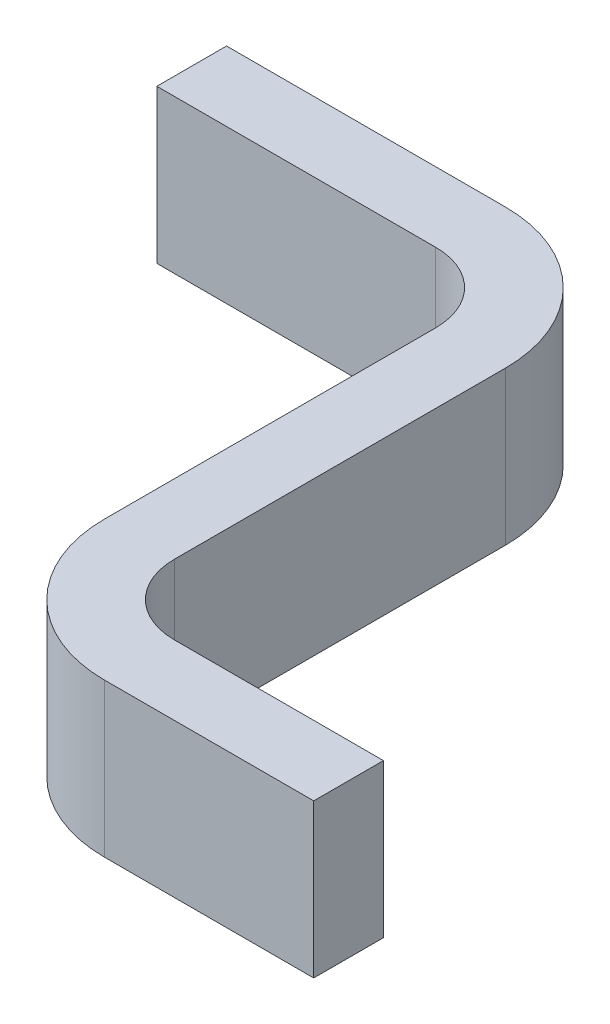
ISO-10303-21;
HEADER;
FILE_DESCRIPTION(('STEP AP214'),'2;1');
FILE_NAME('part.step','',(''),(''),'','','');
FILE_SCHEMA(('AUTOMOTIVE_DESIGN { 1 0 10303 214 1 1 1 1 }'));
ENDSEC;
DATA;
#1=APPLICATION_CONTEXT('core data for automotive mechanical design processes');
#2=APPLICATION_PROTOCOL_DEFINITION('international standard','automotive_design',2000,#1);
#3=PRODUCT_CONTEXT('',#1,'mechanical');
#4=PRODUCT('Part','Part','',(#3));
#5=PRODUCT_RELATED_PRODUCT_CATEGORY('part','',(#4));
#6=PRODUCT_DEFINITION_FORMATION('','',#4);
#7=PRODUCT_DEFINITION_CONTEXT('part definition',#1,'design');
#8=PRODUCT_DEFINITION('design','',#6,#7);
#9=PRODUCT_DEFINITION_SHAPE('','',#8);
#10=(LENGTH_UNIT() NAMED_UNIT(*) SI_UNIT(.MILLI.,.METRE.));
#11=(NAMED_UNIT(*) PLANE_ANGLE_UNIT() SI_UNIT($,.RADIAN.));
#12=(NAMED_UNIT(*) SI_UNIT($,.STERADIAN.) SOLID_ANGLE_UNIT());
#13=UNCERTAINTY_MEASURE_WITH_UNIT(LENGTH_MEASURE(1.E-05),#10,'distance_accuracy_value','');
#14=(GEOMETRIC_REPRESENTATION_CONTEXT(3) GLOBAL_UNCERTAINTY_ASSIGNED_CONTEXT((#13)) GLOBAL_UNIT_ASSIGNED_CONTEXT((#10,
#11,#12)) REPRESENTATION_CONTEXT('',''));
#15=CARTESIAN_POINT('',(0.,0.,0.));
#16=DIRECTION('',(0.,0.,1.));
#17=DIRECTION('',(1.,0.,0.));
#18=AXIS2_PLACEMENT_3D('',#15,#16,#17);
#19=CARTESIAN_POINT('',(-4.,-1.14,0.675));
#20=DIRECTION('',(0.,-1.,0.));
#21=DIRECTION('',(1.,0.,0.));
#22=AXIS2_PLACEMENT_3D('',#19,#20,#21);
#23=PLANE('',#22);
#24=CARTESIAN_POINT('',(-3.80000000000001,-1.14,0.675));
#25=DIRECTION('',(0.,1.,0.));
#26=DIRECTION('',(-1.,0.,0.));
#27=AXIS2_PLACEMENT_3D('',#24,#25,#26);
#28=CIRCLE('',#27,0.2);
#29=CARTESIAN_POINT('',(-3.80000000000001,-1.14,0.875));
#30=VERTEX_POINT('',#29);
#31=CARTESIAN_POINT('',(-4.,-1.14,0.675));
#32=VERTEX_POINT('',#31);
#33=EDGE_CURVE('E150',#30,#32,#28,.F.);
#34=ORIENTED_EDGE('',*,*,#33,.F.);
#35=DIRECTION('',(-1.,0.,0.));
#36=VECTOR('',#35,1.);
#37=CARTESIAN_POINT('',(-3.5,-1.14,0.875));
#38=LINE('',#37,#36);
#39=CARTESIAN_POINT('',(-3.5,-1.14,0.875));
#40=VERTEX_POINT('',#39);
#41=EDGE_CURVE('E147',#30,#40,#38,.F.);
#42=ORIENTED_EDGE('',*,*,#41,.T.);
#43=DIRECTION('',(0.,0.,1.));
#44=VECTOR('',#43,1.);
#45=CARTESIAN_POINT('',(-3.5,-1.14,0.775));
#46=LINE('',#45,#44);
#47=CARTESIAN_POINT('',(-3.5,-1.14,0.775));
#48=VERTEX_POINT('',#47);
#49=EDGE_CURVE('E141',#48,#40,#46,.T.);
#50=ORIENTED_EDGE('',*,*,#49,.F.);
#51=DIRECTION('',(1.,0.,0.));
#52=VECTOR('',#51,1.);
#53=CARTESIAN_POINT('',(-3.5,-1.14,0.775));
#54=LINE('',#53,#52);
#55=CARTESIAN_POINT('',(-3.80000000000001,-1.14,0.775));
#56=VERTEX_POINT('',#55);
#57=EDGE_CURVE('E115',#48,#56,#54,.F.);
#58=ORIENTED_EDGE('',*,*,#57,.T.);
#59=CARTESIAN_POINT('',(-3.80000000000001,-1.14,0.675));
#60=DIRECTION('',(0.,1.,0.));
#61=DIRECTION('',(-1.,0.,0.));
#62=AXIS2_PLACEMENT_3D('',#59,#60,#61);
#63=CIRCLE('',#62,0.1);
#64=CARTESIAN_POINT('',(-3.9,-1.14,0.675));
#65=VERTEX_POINT('',#64);
#66=EDGE_CURVE('E215',#56,#65,#63,.F.);
#67=ORIENTED_EDGE('',*,*,#66,.T.);
#68=DIRECTION('',(0.,0.,1.));
#69=VECTOR('',#68,1.);
#70=CARTESIAN_POINT('',(-3.9,-1.14,0.675));
#71=LINE('',#70,#69);
#72=CARTESIAN_POINT('',(-3.9,-1.14,0.2));
#73=VERTEX_POINT('',#72);
#74=EDGE_CURVE('E181',#65,#73,#71,.F.);
#75=ORIENTED_EDGE('',*,*,#74,.T.);
#76=CARTESIAN_POINT('',(-4.1,-1.14,0.2));
#77=DIRECTION('',(0.,-1.,0.));
#78=DIRECTION('',(1.,0.,0.));
#79=AXIS2_PLACEMENT_3D('',#76,#77,#78);
#80=CIRCLE('',#79,0.2);
#81=CARTESIAN_POINT('',(-4.1,-1.14,0.));
#82=VERTEX_POINT('',#81);
#83=EDGE_CURVE('E20',#82,#73,#80,.T.);
#84=ORIENTED_EDGE('',*,*,#83,.F.);
#85=DIRECTION('',(1.,0.,0.));
#86=VECTOR('',#85,1.);
#87=CARTESIAN_POINT('',(-4.1,-1.14,0.));
#88=LINE('',#87,#86);
#89=CARTESIAN_POINT('',(-4.5,-1.14,0.));
#90=VERTEX_POINT('',#89);
#91=EDGE_CURVE('E91',#82,#90,#88,.F.);
#92=ORIENTED_EDGE('',*,*,#91,.T.);
#93=DIRECTION('',(0.,0.,1.));
#94=VECTOR('',#93,1.);
#95=CARTESIAN_POINT('',(-4.5,-1.14,0.));
#96=LINE('',#95,#94);
#97=CARTESIAN_POINT('',(-4.5,-1.14,0.1));
#98=VERTEX_POINT('',#97);
#99=EDGE_CURVE('E163',#90,#98,#96,.T.);
#100=ORIENTED_EDGE('',*,*,#99,.T.);
#101=DIRECTION('',(-1.,0.,0.));
#102=VECTOR('',#101,1.);
#103=CARTESIAN_POINT('',(-4.1,-1.14,0.1));
#104=LINE('',#103,#102);
#105=CARTESIAN_POINT('',(-4.1,-1.14,0.1));
#106=VERTEX_POINT('',#105);
#107=EDGE_CURVE('E159',#98,#106,#104,.F.);
#108=ORIENTED_EDGE('',*,*,#107,.T.);
#109=CARTESIAN_POINT('',(-4.1,-1.14,0.2));
#110=DIRECTION('',(0.,-1.,0.));
#111=DIRECTION('',(1.,0.,0.));
#112=AXIS2_PLACEMENT_3D('',#109,#110,#111);
#113=CIRCLE('',#112,0.1);
#114=CARTESIAN_POINT('',(-4.,-1.14,0.2));
#115=VERTEX_POINT('',#114);
#116=EDGE_CURVE('E155',#106,#115,#113,.T.);
#117=ORIENTED_EDGE('',*,*,#116,.T.);
#118=DIRECTION('',(0.,0.,1.));
#119=VECTOR('',#118,1.);
#120=CARTESIAN_POINT('',(-4.,-1.14,0.675));
#121=LINE('',#120,#119);
#122=EDGE_CURVE('E154',#115,#32,#121,.T.);
#123=ORIENTED_EDGE('',*,*,#122,.T.);
#124=EDGE_LOOP('',(#34,#42,#50,#58,#67,#75,#84,#92,#100,#108,#117,#123));
#125=FACE_BOUND('',#124,.T.);
#126=ADVANCED_FACE('F17',(#125),#23,.F.);
#127=CARTESIAN_POINT('',(-4.1,-1.14,0.2));
#128=DIRECTION('',(0.,-1.,0.));
#129=DIRECTION('',(1.,0.,0.));
#130=AXIS2_PLACEMENT_3D('',#127,#128,#129);
#131=CYLINDRICAL_SURFACE('',#130,0.2);
#132=CARTESIAN_POINT('',(-4.1,-1.36,0.2));
#133=DIRECTION('',(0.,-1.,0.));
#134=DIRECTION('',(1.,0.,0.));
#135=AXIS2_PLACEMENT_3D('',#132,#133,#134);
#136=CIRCLE('',#135,0.2);
#137=CARTESIAN_POINT('',(-3.9,-1.36,0.2));
#138=VERTEX_POINT('',#137);
#139=CARTESIAN_POINT('',(-4.1,-1.36,0.));
#140=VERTEX_POINT('',#139);
#141=EDGE_CURVE('E183',#138,#140,#136,.F.);
#142=ORIENTED_EDGE('',*,*,#141,.T.);
#143=DIRECTION('',(0.,1.,0.));
#144=VECTOR('',#143,1.);
#145=CARTESIAN_POINT('',(-4.1,-1.14,0.));
#146=LINE('',#145,#144);
#147=EDGE_CURVE('E178',#140,#82,#146,.T.);
#148=ORIENTED_EDGE('',*,*,#147,.T.);
#149=ORIENTED_EDGE('',*,*,#83,.T.);
#150=DIRECTION('',(0.,-1.,0.));
#151=VECTOR('',#150,1.);
#152=CARTESIAN_POINT('',(-3.9,-1.14,0.2));
#153=LINE('',#152,#151);
#154=EDGE_CURVE('E217',#73,#138,#153,.T.);
#155=ORIENTED_EDGE('',*,*,#154,.T.);
#156=EDGE_LOOP('',(#142,#148,#149,#155));
#157=FACE_BOUND('',#156,.T.);
#158=ADVANCED_FACE('F254',(#157),#131,.T.);
#159=CARTESIAN_POINT('',(-4.1,-1.14,0.));
#160=DIRECTION('',(0.,0.,1.));
#161=DIRECTION('',(1.,0.,0.));
#162=AXIS2_PLACEMENT_3D('',#159,#160,#161);
#163=PLANE('',#162);
#164=ORIENTED_EDGE('',*,*,#147,.F.);
#165=DIRECTION('',(-1.,0.,0.));
#166=VECTOR('',#165,1.);
#167=CARTESIAN_POINT('',(-3.9,-1.36,0.));
#168=LINE('',#167,#166);
#169=CARTESIAN_POINT('',(-4.5,-1.36,0.));
#170=VERTEX_POINT('',#169);
#171=EDGE_CURVE('E170',#140,#170,#168,.T.);
#172=ORIENTED_EDGE('',*,*,#171,.T.);
#173=DIRECTION('',(0.,1.,0.));
#174=VECTOR('',#173,1.);
#175=CARTESIAN_POINT('',(-4.5,-1.14,0.));
#176=LINE('',#175,#174);
#177=EDGE_CURVE('E173',#170,#90,#176,.T.);
#178=ORIENTED_EDGE('',*,*,#177,.T.);
#179=ORIENTED_EDGE('',*,*,#91,.F.);
#180=EDGE_LOOP('',(#164,#172,#178,#179));
#181=FACE_BOUND('',#180,.T.);
#182=ADVANCED_FACE('F257',(#181),#163,.F.);
#183=CARTESIAN_POINT('',(-4.5,-1.14,0.));
#184=DIRECTION('',(1.,0.,0.));
#185=DIRECTION('',(0.,1.,0.));
#186=AXIS2_PLACEMENT_3D('',#183,#184,#185);
#187=PLANE('',#186);
#188=DIRECTION('',(0.,1.,0.));
#189=VECTOR('',#188,1.);
#190=CARTESIAN_POINT('',(-4.5,-1.36,0.1));
#191=LINE('',#190,#189);
#192=CARTESIAN_POINT('',(-4.5,-1.36,0.1));
#193=VERTEX_POINT('',#192);
#194=EDGE_CURVE('E160',#193,#98,#191,.T.);
#195=ORIENTED_EDGE('',*,*,#194,.T.);
#196=ORIENTED_EDGE('',*,*,#99,.F.);
#197=ORIENTED_EDGE('',*,*,#177,.F.);
#198=DIRECTION('',(0.,0.,1.));
#199=VECTOR('',#198,1.);
#200=CARTESIAN_POINT('',(-4.5,-1.36,0.675));
#201=LINE('',#200,#199);
#202=EDGE_CURVE('E166',#170,#193,#201,.T.);
#203=ORIENTED_EDGE('',*,*,#202,.T.);
#204=EDGE_LOOP('',(#195,#196,#197,#203));
#205=FACE_BOUND('',#204,.T.);
#206=ADVANCED_FACE('F259',(#205),#187,.F.);
#207=CARTESIAN_POINT('',(-4.1,-1.36,0.1));
#208=DIRECTION('',(0.,0.,-1.));
#209=DIRECTION('',(-1.,0.,0.));
#210=AXIS2_PLACEMENT_3D('',#207,#208,#209);
#211=PLANE('',#210);
#212=DIRECTION('',(0.,-1.,0.));
#213=VECTOR('',#212,1.);
#214=CARTESIAN_POINT('',(-4.1,-1.36,0.1));
#215=LINE('',#214,#213);
#216=CARTESIAN_POINT('',(-4.1,-1.36,0.1));
#217=VERTEX_POINT('',#216);
#218=EDGE_CURVE('E156',#217,#106,#215,.F.);
#219=ORIENTED_EDGE('',*,*,#218,.T.);
#220=ORIENTED_EDGE('',*,*,#107,.F.);
#221=ORIENTED_EDGE('',*,*,#194,.F.);
#222=DIRECTION('',(-1.,0.,0.));
#223=VECTOR('',#222,1.);
#224=CARTESIAN_POINT('',(-3.9,-1.36,0.1));
#225=LINE('',#224,#223);
#226=EDGE_CURVE('E169',#193,#217,#225,.F.);
#227=ORIENTED_EDGE('',*,*,#226,.T.);
#228=EDGE_LOOP('',(#219,#220,#221,#227));
#229=FACE_BOUND('',#228,.T.);
#230=ADVANCED_FACE('F234',(#229),#211,.F.);
#231=CARTESIAN_POINT('',(-4.1,-1.36,0.2));
#232=DIRECTION('',(0.,-1.,0.));
#233=DIRECTION('',(1.,0.,0.));
#234=AXIS2_PLACEMENT_3D('',#231,#232,#233);
#235=CYLINDRICAL_SURFACE('',#234,0.1);
#236=DIRECTION('',(0.,1.,0.));
#237=VECTOR('',#236,1.);
#238=CARTESIAN_POINT('',(-4.,-1.36,0.2));
#239=LINE('',#238,#237);
#240=CARTESIAN_POINT('',(-4.,-1.36,0.2));
#241=VERTEX_POINT('',#240);
#242=EDGE_CURVE('E151',#241,#115,#239,.T.);
#243=ORIENTED_EDGE('',*,*,#242,.T.);
#244=ORIENTED_EDGE('',*,*,#116,.F.);
#245=ORIENTED_EDGE('',*,*,#218,.F.);
#246=CARTESIAN_POINT('',(-4.1,-1.36,0.2));
#247=DIRECTION('',(0.,-1.,0.));
#248=DIRECTION('',(1.,0.,0.));
#249=AXIS2_PLACEMENT_3D('',#246,#247,#248);
#250=CIRCLE('',#249,0.1);
#251=EDGE_CURVE('E210',#217,#241,#250,.T.);
#252=ORIENTED_EDGE('',*,*,#251,.T.);
#253=EDGE_LOOP('',(#243,#244,#245,#252));
#254=FACE_BOUND('',#253,.T.);
#255=ADVANCED_FACE('F227',(#254),#235,.F.);
#256=CARTESIAN_POINT('',(-4.,-1.36,0.675));
#257=DIRECTION('',(1.,0.,0.));
#258=DIRECTION('',(0.,1.,0.));
#259=AXIS2_PLACEMENT_3D('',#256,#257,#258);
#260=PLANE('',#259);
#261=DIRECTION('',(0.,1.,0.));
#262=VECTOR('',#261,1.);
#263=CARTESIAN_POINT('',(-4.,-1.36,0.675));
#264=LINE('',#263,#262);
#265=CARTESIAN_POINT('',(-4.,-1.36,0.675));
#266=VERTEX_POINT('',#265);
#267=EDGE_CURVE('E148',#32,#266,#264,.F.);
#268=ORIENTED_EDGE('',*,*,#267,.F.);
#269=ORIENTED_EDGE('',*,*,#122,.F.);
#270=ORIENTED_EDGE('',*,*,#242,.F.);
#271=DIRECTION('',(0.,0.,1.));
#272=VECTOR('',#271,1.);
#273=CARTESIAN_POINT('',(-4.,-1.36,0.675));
#274=LINE('',#273,#272);
#275=EDGE_CURVE('E209',#241,#266,#274,.T.);
#276=ORIENTED_EDGE('',*,*,#275,.T.);
#277=EDGE_LOOP('',(#268,#269,#270,#276));
#278=FACE_BOUND('',#277,.T.);
#279=ADVANCED_FACE('F224',(#278),#260,.F.);
#280=CARTESIAN_POINT('',(-3.8,-1.36,0.675));
#281=DIRECTION('',(0.,1.,0.));
#282=DIRECTION('',(-1.,0.,0.));
#283=AXIS2_PLACEMENT_3D('',#280,#281,#282);
#284=CYLINDRICAL_SURFACE('',#283,0.2);
#285=ORIENTED_EDGE('',*,*,#33,.T.);
#286=ORIENTED_EDGE('',*,*,#267,.T.);
#287=CARTESIAN_POINT('',(-3.8,-1.36,0.675));
#288=DIRECTION('',(0.,1.,0.));
#289=DIRECTION('',(-1.,0.,0.));
#290=AXIS2_PLACEMENT_3D('',#287,#288,#289);
#291=CIRCLE('',#290,0.2);
#292=CARTESIAN_POINT('',(-3.8,-1.36,0.875));
#293=VERTEX_POINT('',#292);
#294=EDGE_CURVE('E133',#266,#293,#291,.T.);
#295=ORIENTED_EDGE('',*,*,#294,.T.);
#296=DIRECTION('',(0.,1.,0.));
#297=VECTOR('',#296,1.);
#298=CARTESIAN_POINT('',(-3.8,-1.36,0.875));
#299=LINE('',#298,#297);
#300=EDGE_CURVE('E144',#293,#30,#299,.T.);
#301=ORIENTED_EDGE('',*,*,#300,.T.);
#302=EDGE_LOOP('',(#285,#286,#295,#301));
#303=FACE_BOUND('',#302,.T.);
#304=ADVANCED_FACE('F285',(#303),#284,.T.);
#305=CARTESIAN_POINT('',(-3.5,-1.36,0.875));
#306=DIRECTION('',(0.,0.,-1.));
#307=DIRECTION('',(-1.,0.,0.));
#308=AXIS2_PLACEMENT_3D('',#305,#306,#307);
#309=PLANE('',#308);
#310=DIRECTION('',(0.,1.,0.));
#311=VECTOR('',#310,1.);
#312=CARTESIAN_POINT('',(-3.5,-1.14,0.875));
#313=LINE('',#312,#311);
#314=CARTESIAN_POINT('',(-3.5,-1.36,0.875));
#315=VERTEX_POINT('',#314);
#316=EDGE_CURVE('E118',#40,#315,#313,.F.);
#317=ORIENTED_EDGE('',*,*,#316,.F.);
#318=ORIENTED_EDGE('',*,*,#41,.F.);
#319=ORIENTED_EDGE('',*,*,#300,.F.);
#320=DIRECTION('',(-1.,0.,0.));
#321=VECTOR('',#320,1.);
#322=CARTESIAN_POINT('',(-3.9,-1.36,0.875));
#323=LINE('',#322,#321);
#324=EDGE_CURVE('E131',#293,#315,#323,.F.);
#325=ORIENTED_EDGE('',*,*,#324,.T.);
#326=EDGE_LOOP('',(#317,#318,#319,#325));
#327=FACE_BOUND('',#326,.T.);
#328=ADVANCED_FACE('F282',(#327),#309,.F.);
#329=CARTESIAN_POINT('',(-3.5,-1.14,0.775));
#330=DIRECTION('',(1.,0.,0.));
#331=DIRECTION('',(0.,1.,0.));
#332=AXIS2_PLACEMENT_3D('',#329,#330,#331);
#333=PLANE('',#332);
#334=ORIENTED_EDGE('',*,*,#49,.T.);
#335=ORIENTED_EDGE('',*,*,#316,.T.);
#336=DIRECTION('',(0.,0.,1.));
#337=VECTOR('',#336,1.);
#338=CARTESIAN_POINT('',(-3.5,-1.36,0.675));
#339=LINE('',#338,#337);
#340=CARTESIAN_POINT('',(-3.5,-1.36,0.775));
#341=VERTEX_POINT('',#340);
#342=EDGE_CURVE('E125',#315,#341,#339,.F.);
#343=ORIENTED_EDGE('',*,*,#342,.T.);
#344=DIRECTION('',(0.,1.,0.));
#345=VECTOR('',#344,1.);
#346=CARTESIAN_POINT('',(-3.5,-1.14,0.775));
#347=LINE('',#346,#345);
#348=EDGE_CURVE('E110',#341,#48,#347,.T.);
#349=ORIENTED_EDGE('',*,*,#348,.T.);
#350=EDGE_LOOP('',(#334,#335,#343,#349));
#351=FACE_BOUND('',#350,.T.);
#352=ADVANCED_FACE('F129',(#351),#333,.T.);
#353=CARTESIAN_POINT('',(-3.5,-1.14,0.775));
#354=DIRECTION('',(0.,0.,1.));
#355=DIRECTION('',(1.,0.,0.));
#356=AXIS2_PLACEMENT_3D('',#353,#354,#355);
#357=PLANE('',#356);
#358=ORIENTED_EDGE('',*,*,#348,.F.);
#359=DIRECTION('',(-1.,0.,0.));
#360=VECTOR('',#359,1.);
#361=CARTESIAN_POINT('',(-3.9,-1.36,0.775));
#362=LINE('',#361,#360);
#363=CARTESIAN_POINT('',(-3.8,-1.36,0.775));
#364=VERTEX_POINT('',#363);
#365=EDGE_CURVE('E114',#341,#364,#362,.T.);
#366=ORIENTED_EDGE('',*,*,#365,.T.);
#367=DIRECTION('',(0.,1.,0.));
#368=VECTOR('',#367,1.);
#369=CARTESIAN_POINT('',(-3.80000000000001,-1.14,0.775));
#370=LINE('',#369,#368);
#371=EDGE_CURVE('E185',#364,#56,#370,.T.);
#372=ORIENTED_EDGE('',*,*,#371,.T.);
#373=ORIENTED_EDGE('',*,*,#57,.F.);
#374=EDGE_LOOP('',(#358,#366,#372,#373));
#375=FACE_BOUND('',#374,.T.);
#376=ADVANCED_FACE('F112',(#375),#357,.F.);
#377=CARTESIAN_POINT('',(-3.80000000000001,-1.14,0.675));
#378=DIRECTION('',(0.,1.,0.));
#379=DIRECTION('',(-1.,0.,0.));
#380=AXIS2_PLACEMENT_3D('',#377,#378,#379);
#381=CYLINDRICAL_SURFACE('',#380,0.1);
#382=ORIENTED_EDGE('',*,*,#371,.F.);
#383=CARTESIAN_POINT('',(-3.8,-1.36,0.675));
#384=DIRECTION('',(0.,1.,0.));
#385=DIRECTION('',(-1.,0.,0.));
#386=AXIS2_PLACEMENT_3D('',#383,#384,#385);
#387=CIRCLE('',#386,0.1);
#388=CARTESIAN_POINT('',(-3.9,-1.36,0.675));
#389=VERTEX_POINT('',#388);
#390=EDGE_CURVE('E26',#364,#389,#387,.F.);
#391=ORIENTED_EDGE('',*,*,#390,.T.);
#392=DIRECTION('',(0.,-1.,0.));
#393=VECTOR('',#392,1.);
#394=CARTESIAN_POINT('',(-3.9,-1.14,0.675));
#395=LINE('',#394,#393);
#396=EDGE_CURVE('E34',#389,#65,#395,.F.);
#397=ORIENTED_EDGE('',*,*,#396,.T.);
#398=ORIENTED_EDGE('',*,*,#66,.F.);
#399=EDGE_LOOP('',(#382,#391,#397,#398));
#400=FACE_BOUND('',#399,.T.);
#401=ADVANCED_FACE('F250',(#400),#381,.F.);
#402=CARTESIAN_POINT('',(-3.9,-1.14,0.675));
#403=DIRECTION('',(-1.,0.,0.));
#404=DIRECTION('',(0.,-1.,0.));
#405=AXIS2_PLACEMENT_3D('',#402,#403,#404);
#406=PLANE('',#405);
#407=ORIENTED_EDGE('',*,*,#396,.F.);
#408=DIRECTION('',(0.,0.,1.));
#409=VECTOR('',#408,1.);
#410=CARTESIAN_POINT('',(-3.9,-1.36,0.675));
#411=LINE('',#410,#409);
#412=EDGE_CURVE('E11',#389,#138,#411,.F.);
#413=ORIENTED_EDGE('',*,*,#412,.T.);
#414=ORIENTED_EDGE('',*,*,#154,.F.);
#415=ORIENTED_EDGE('',*,*,#74,.F.);
#416=EDGE_LOOP('',(#407,#413,#414,#415));
#417=FACE_BOUND('',#416,.T.);
#418=ADVANCED_FACE('F252',(#417),#406,.F.);
#419=CARTESIAN_POINT('',(-3.9,-1.36,0.675));
#420=DIRECTION('',(0.,1.,0.));
#421=DIRECTION('',(-1.,0.,0.));
#422=AXIS2_PLACEMENT_3D('',#419,#420,#421);
#423=PLANE('',#422);
#424=ORIENTED_EDGE('',*,*,#390,.F.);
#425=ORIENTED_EDGE('',*,*,#365,.F.);
#426=ORIENTED_EDGE('',*,*,#342,.F.);
#427=ORIENTED_EDGE('',*,*,#324,.F.);
#428=ORIENTED_EDGE('',*,*,#294,.F.);
#429=ORIENTED_EDGE('',*,*,#275,.F.);
#430=ORIENTED_EDGE('',*,*,#251,.F.);
#431=ORIENTED_EDGE('',*,*,#226,.F.);
#432=ORIENTED_EDGE('',*,*,#202,.F.);
#433=ORIENTED_EDGE('',*,*,#171,.F.);
#434=ORIENTED_EDGE('',*,*,#141,.F.);
#435=ORIENTED_EDGE('',*,*,#412,.F.);
#436=EDGE_LOOP('',(#424,#425,#426,#427,#428,#429,#430,#431,#432,#433,#434,#435));
#437=FACE_BOUND('',#436,.T.);
#438=ADVANCED_FACE('F123',(#437),#423,.F.);
#439=CLOSED_SHELL('',(#126,#158,#182,#206,#230,#255,#279,#304,#328,#352,#376,#401,#418,#438));
#440=MANIFOLD_SOLID_BREP('B1',#439);
#441=ADVANCED_BREP_SHAPE_REPRESENTATION('',(#18,#440),#14);
#442=SHAPE_DEFINITION_REPRESENTATION(#9,#441);
ENDSEC;
END-ISO-10303-21;
